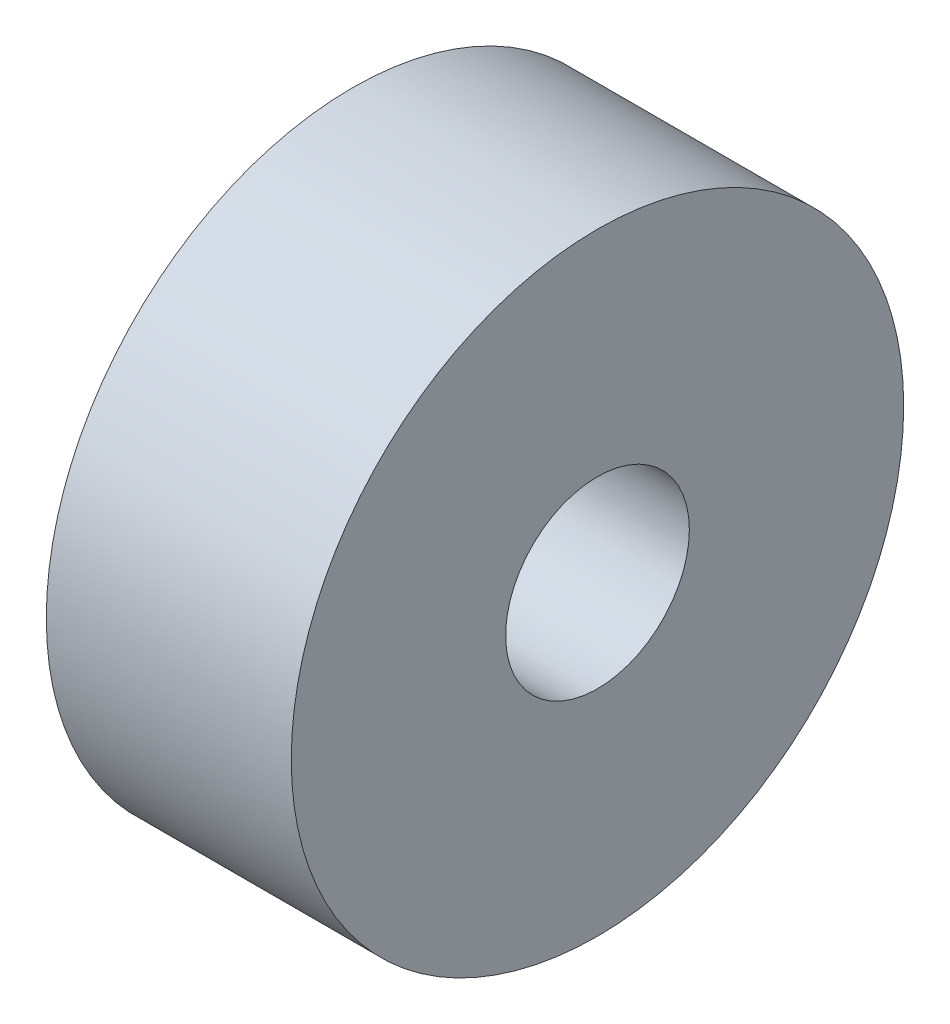
ISO-10303-21;
HEADER;
FILE_DESCRIPTION(('STEP AP214'),'2;1');
FILE_NAME('part.step','',(''),(''),'','','');
FILE_SCHEMA(('AUTOMOTIVE_DESIGN { 1 0 10303 214 1 1 1 1 }'));
ENDSEC;
DATA;
#1=APPLICATION_CONTEXT('core data for automotive mechanical design processes');
#2=APPLICATION_PROTOCOL_DEFINITION('international standard','automotive_design',2000,#1);
#3=PRODUCT_CONTEXT('',#1,'mechanical');
#4=PRODUCT('Part','Part','',(#3));
#5=PRODUCT_RELATED_PRODUCT_CATEGORY('part','',(#4));
#6=PRODUCT_DEFINITION_FORMATION('','',#4);
#7=PRODUCT_DEFINITION_CONTEXT('part definition',#1,'design');
#8=PRODUCT_DEFINITION('design','',#6,#7);
#9=PRODUCT_DEFINITION_SHAPE('','',#8);
#10=(LENGTH_UNIT() NAMED_UNIT(*) SI_UNIT(.MILLI.,.METRE.));
#11=(NAMED_UNIT(*) PLANE_ANGLE_UNIT() SI_UNIT($,.RADIAN.));
#12=(NAMED_UNIT(*) SI_UNIT($,.STERADIAN.) SOLID_ANGLE_UNIT());
#13=UNCERTAINTY_MEASURE_WITH_UNIT(LENGTH_MEASURE(1.E-05),#10,'distance_accuracy_value','');
#14=(GEOMETRIC_REPRESENTATION_CONTEXT(3) GLOBAL_UNCERTAINTY_ASSIGNED_CONTEXT((#13)) GLOBAL_UNIT_ASSIGNED_CONTEXT((#10,
#11,#12)) REPRESENTATION_CONTEXT('',''));
#15=CARTESIAN_POINT('',(0.,0.,0.));
#16=DIRECTION('',(0.,0.,1.));
#17=DIRECTION('',(1.,0.,0.));
#18=AXIS2_PLACEMENT_3D('',#15,#16,#17);
#19=CARTESIAN_POINT('',(4.,0.,0.));
#20=DIRECTION('',(1.,0.,0.));
#21=DIRECTION('',(0.,0.,-1.));
#22=AXIS2_PLACEMENT_3D('',#19,#20,#21);
#23=PLANE('',#22);
#24=CARTESIAN_POINT('',(4.,0.,0.));
#25=DIRECTION('',(1.,0.,0.));
#26=DIRECTION('',(0.,0.,-1.));
#27=AXIS2_PLACEMENT_3D('',#24,#25,#26);
#28=CIRCLE('',#27,5.);
#29=CARTESIAN_POINT('',(4.,0.,-5.));
#30=VERTEX_POINT('',#29);
#31=EDGE_CURVE('E10',#30,#30,#28,.T.);
#32=ORIENTED_EDGE('',*,*,#31,.T.);
#33=EDGE_LOOP('',(#32));
#34=FACE_BOUND('',#33,.T.);
#35=CARTESIAN_POINT('',(4.,0.,0.));
#36=DIRECTION('',(1.,0.,0.));
#37=DIRECTION('',(0.,0.,-1.));
#38=AXIS2_PLACEMENT_3D('',#35,#36,#37);
#39=CIRCLE('',#38,1.5);
#40=CARTESIAN_POINT('',(4.,0.,-1.5));
#41=VERTEX_POINT('',#40);
#42=EDGE_CURVE('E44',#41,#41,#39,.T.);
#43=ORIENTED_EDGE('',*,*,#42,.F.);
#44=EDGE_LOOP('',(#43));
#45=FACE_BOUND('',#44,.T.);
#46=ADVANCED_FACE('F33',(#34,#45),#23,.T.);
#47=CARTESIAN_POINT('',(0.,0.,0.));
#48=DIRECTION('',(1.,0.,0.));
#49=DIRECTION('',(0.,0.,-1.));
#50=AXIS2_PLACEMENT_3D('',#47,#48,#49);
#51=PLANE('',#50);
#52=CARTESIAN_POINT('',(0.,0.,0.));
#53=DIRECTION('',(1.,0.,0.));
#54=DIRECTION('',(0.,0.,-1.));
#55=AXIS2_PLACEMENT_3D('',#52,#53,#54);
#56=CIRCLE('',#55,5.);
#57=CARTESIAN_POINT('',(0.,0.,-5.));
#58=VERTEX_POINT('',#57);
#59=EDGE_CURVE('E37',#58,#58,#56,.T.);
#60=ORIENTED_EDGE('',*,*,#59,.F.);
#61=EDGE_LOOP('',(#60));
#62=FACE_BOUND('',#61,.T.);
#63=CARTESIAN_POINT('',(0.,0.,0.));
#64=DIRECTION('',(1.,0.,0.));
#65=DIRECTION('',(0.,0.,-1.));
#66=AXIS2_PLACEMENT_3D('',#63,#64,#65);
#67=CIRCLE('',#66,1.5);
#68=CARTESIAN_POINT('',(0.,0.,-1.5));
#69=VERTEX_POINT('',#68);
#70=EDGE_CURVE('E46',#69,#69,#67,.T.);
#71=ORIENTED_EDGE('',*,*,#70,.T.);
#72=EDGE_LOOP('',(#71));
#73=FACE_BOUND('',#72,.T.);
#74=ADVANCED_FACE('F56',(#62,#73),#51,.F.);
#75=CARTESIAN_POINT('',(4.,0.,0.));
#76=DIRECTION('',(-1.,0.,0.));
#77=DIRECTION('',(0.,0.,1.));
#78=AXIS2_PLACEMENT_3D('',#75,#76,#77);
#79=CYLINDRICAL_SURFACE('',#78,5.);
#80=ORIENTED_EDGE('',*,*,#31,.F.);
#81=EDGE_LOOP('',(#80));
#82=FACE_BOUND('',#81,.T.);
#83=ORIENTED_EDGE('',*,*,#59,.T.);
#84=EDGE_LOOP('',(#83));
#85=FACE_BOUND('',#84,.T.);
#86=ADVANCED_FACE('F35',(#82,#85),#79,.T.);
#87=CARTESIAN_POINT('',(4.,0.,0.));
#88=DIRECTION('',(-1.,0.,0.));
#89=DIRECTION('',(0.,0.,1.));
#90=AXIS2_PLACEMENT_3D('',#87,#88,#89);
#91=CYLINDRICAL_SURFACE('',#90,1.5);
#92=ORIENTED_EDGE('',*,*,#42,.T.);
#93=EDGE_LOOP('',(#92));
#94=FACE_BOUND('',#93,.T.);
#95=ORIENTED_EDGE('',*,*,#70,.F.);
#96=EDGE_LOOP('',(#95));
#97=FACE_BOUND('',#96,.T.);
#98=ADVANCED_FACE('F52',(#94,#97),#91,.F.);
#99=CLOSED_SHELL('',(#46,#74,#86,#98));
#100=MANIFOLD_SOLID_BREP('B2',#99);
#101=ADVANCED_BREP_SHAPE_REPRESENTATION('',(#18,#100),#14);
#102=SHAPE_DEFINITION_REPRESENTATION(#9,#101);
ENDSEC;
END-ISO-10303-21;
